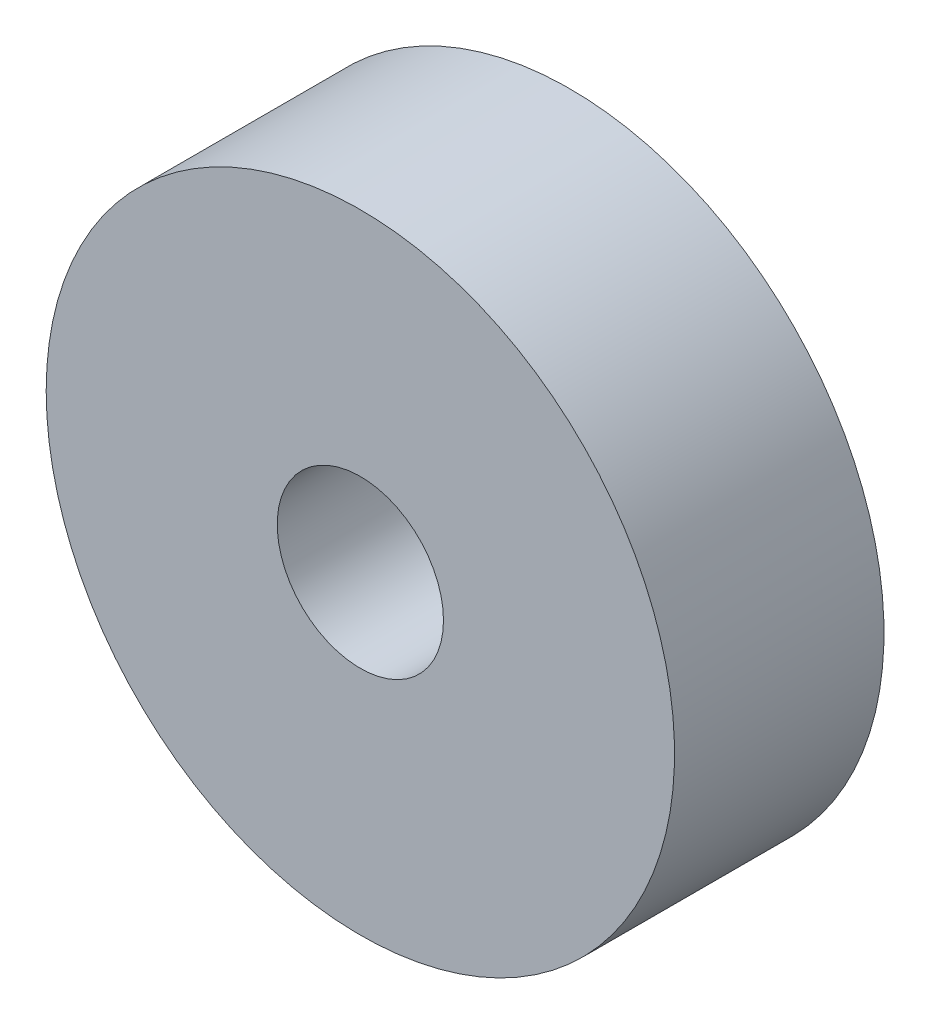
ISO-10303-21;
HEADER;
FILE_DESCRIPTION(('STEP AP214'),'2;1');
FILE_NAME('part.step','',(''),(''),'','','');
FILE_SCHEMA(('AUTOMOTIVE_DESIGN { 1 0 10303 214 1 1 1 1 }'));
ENDSEC;
DATA;
#1=APPLICATION_CONTEXT('core data for automotive mechanical design processes');
#2=APPLICATION_PROTOCOL_DEFINITION('international standard','automotive_design',2000,#1);
#3=PRODUCT_CONTEXT('',#1,'mechanical');
#4=PRODUCT('Part','Part','',(#3));
#5=PRODUCT_RELATED_PRODUCT_CATEGORY('part','',(#4));
#6=PRODUCT_DEFINITION_FORMATION('','',#4);
#7=PRODUCT_DEFINITION_CONTEXT('part definition',#1,'design');
#8=PRODUCT_DEFINITION('design','',#6,#7);
#9=PRODUCT_DEFINITION_SHAPE('','',#8);
#10=(LENGTH_UNIT() NAMED_UNIT(*) SI_UNIT(.MILLI.,.METRE.));
#11=(NAMED_UNIT(*) PLANE_ANGLE_UNIT() SI_UNIT($,.RADIAN.));
#12=(NAMED_UNIT(*) SI_UNIT($,.STERADIAN.) SOLID_ANGLE_UNIT());
#13=UNCERTAINTY_MEASURE_WITH_UNIT(LENGTH_MEASURE(1.E-05),#10,'distance_accuracy_value','');
#14=(GEOMETRIC_REPRESENTATION_CONTEXT(3) GLOBAL_UNCERTAINTY_ASSIGNED_CONTEXT((#13)) GLOBAL_UNIT_ASSIGNED_CONTEXT((#10,
#11,#12)) REPRESENTATION_CONTEXT('',''));
#15=CARTESIAN_POINT('',(0.,0.,0.));
#16=DIRECTION('',(0.,0.,1.));
#17=DIRECTION('',(1.,0.,0.));
#18=AXIS2_PLACEMENT_3D('',#15,#16,#17);
#19=CARTESIAN_POINT('',(0.,0.,-2.));
#20=DIRECTION('',(0.,0.,1.));
#21=DIRECTION('',(1.,0.,0.));
#22=AXIS2_PLACEMENT_3D('',#19,#20,#21);
#23=PLANE('',#22);
#24=CARTESIAN_POINT('',(0.,0.,-2.));
#25=DIRECTION('',(0.,0.,-1.));
#26=DIRECTION('',(-1.,0.,0.));
#27=AXIS2_PLACEMENT_3D('',#24,#25,#26);
#28=CIRCLE('',#27,6.);
#29=CARTESIAN_POINT('',(-6.,0.,-2.));
#30=VERTEX_POINT('',#29);
#31=EDGE_CURVE('E27',#30,#30,#28,.F.);
#32=ORIENTED_EDGE('',*,*,#31,.F.);
#33=EDGE_LOOP('',(#32));
#34=FACE_BOUND('',#33,.T.);
#35=CARTESIAN_POINT('',(0.,0.,-2.));
#36=DIRECTION('',(0.,0.,1.));
#37=DIRECTION('',(1.,0.,0.));
#38=AXIS2_PLACEMENT_3D('',#35,#36,#37);
#39=CIRCLE('',#38,1.5875);
#40=CARTESIAN_POINT('',(1.5875,0.,-2.));
#41=VERTEX_POINT('',#40);
#42=EDGE_CURVE('E18',#41,#41,#39,.T.);
#43=ORIENTED_EDGE('',*,*,#42,.T.);
#44=EDGE_LOOP('',(#43));
#45=FACE_BOUND('',#44,.T.);
#46=ADVANCED_FACE('F15',(#34,#45),#23,.F.);
#47=CARTESIAN_POINT('',(0.,0.,-2.));
#48=DIRECTION('',(0.,0.,1.));
#49=DIRECTION('',(1.,0.,0.));
#50=AXIS2_PLACEMENT_3D('',#47,#48,#49);
#51=CYLINDRICAL_SURFACE('',#50,1.5875);
#52=CARTESIAN_POINT('',(0.,0.,2.));
#53=DIRECTION('',(0.,0.,1.));
#54=DIRECTION('',(1.,0.,0.));
#55=AXIS2_PLACEMENT_3D('',#52,#53,#54);
#56=CIRCLE('',#55,1.5875);
#57=CARTESIAN_POINT('',(1.5875,0.,2.));
#58=VERTEX_POINT('',#57);
#59=EDGE_CURVE('E22',#58,#58,#56,.F.);
#60=ORIENTED_EDGE('',*,*,#59,.F.);
#61=EDGE_LOOP('',(#60));
#62=FACE_BOUND('',#61,.T.);
#63=ORIENTED_EDGE('',*,*,#42,.F.);
#64=EDGE_LOOP('',(#63));
#65=FACE_BOUND('',#64,.T.);
#66=ADVANCED_FACE('F36',(#62,#65),#51,.F.);
#67=CARTESIAN_POINT('',(0.,0.,2.));
#68=DIRECTION('',(0.,0.,-1.));
#69=DIRECTION('',(-1.,0.,0.));
#70=AXIS2_PLACEMENT_3D('',#67,#68,#69);
#71=CYLINDRICAL_SURFACE('',#70,6.);
#72=ORIENTED_EDGE('',*,*,#31,.T.);
#73=EDGE_LOOP('',(#72));
#74=FACE_BOUND('',#73,.T.);
#75=CARTESIAN_POINT('',(0.,0.,2.));
#76=DIRECTION('',(0.,0.,-1.));
#77=DIRECTION('',(-1.,0.,0.));
#78=AXIS2_PLACEMENT_3D('',#75,#76,#77);
#79=CIRCLE('',#78,6.);
#80=CARTESIAN_POINT('',(-6.,0.,2.));
#81=VERTEX_POINT('',#80);
#82=EDGE_CURVE('E10',#81,#81,#79,.F.);
#83=ORIENTED_EDGE('',*,*,#82,.F.);
#84=EDGE_LOOP('',(#83));
#85=FACE_BOUND('',#84,.T.);
#86=ADVANCED_FACE('F38',(#74,#85),#71,.T.);
#87=CARTESIAN_POINT('',(0.,0.,2.));
#88=DIRECTION('',(0.,0.,1.));
#89=DIRECTION('',(1.,0.,0.));
#90=AXIS2_PLACEMENT_3D('',#87,#88,#89);
#91=PLANE('',#90);
#92=ORIENTED_EDGE('',*,*,#82,.T.);
#93=EDGE_LOOP('',(#92));
#94=FACE_BOUND('',#93,.T.);
#95=ORIENTED_EDGE('',*,*,#59,.T.);
#96=EDGE_LOOP('',(#95));
#97=FACE_BOUND('',#96,.T.);
#98=ADVANCED_FACE('F45',(#94,#97),#91,.T.);
#99=CLOSED_SHELL('',(#46,#66,#86,#98));
#100=MANIFOLD_SOLID_BREP('B1',#99);
#101=ADVANCED_BREP_SHAPE_REPRESENTATION('',(#18,#100),#14);
#102=SHAPE_DEFINITION_REPRESENTATION(#9,#101);
ENDSEC;
END-ISO-10303-21;
